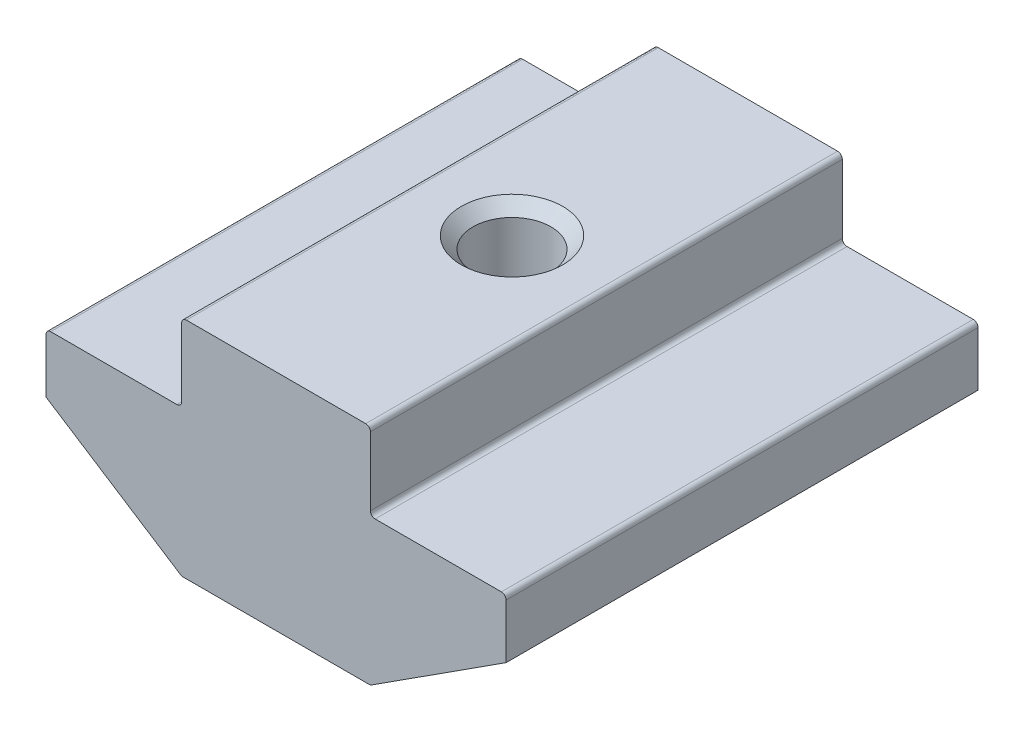
ISO-10303-21;
HEADER;
FILE_DESCRIPTION(('STEP AP214'),'2;1');
FILE_NAME('part.step','',(''),(''),'','','');
FILE_SCHEMA(('AUTOMOTIVE_DESIGN { 1 0 10303 214 1 1 1 1 }'));
ENDSEC;
DATA;
#1=APPLICATION_CONTEXT('core data for automotive mechanical design processes');
#2=APPLICATION_PROTOCOL_DEFINITION('international standard','automotive_design',2000,#1);
#3=PRODUCT_CONTEXT('',#1,'mechanical');
#4=PRODUCT('Part','Part','',(#3));
#5=PRODUCT_RELATED_PRODUCT_CATEGORY('part','',(#4));
#6=PRODUCT_DEFINITION_FORMATION('','',#4);
#7=PRODUCT_DEFINITION_CONTEXT('part definition',#1,'design');
#8=PRODUCT_DEFINITION('design','',#6,#7);
#9=PRODUCT_DEFINITION_SHAPE('','',#8);
#10=(LENGTH_UNIT() NAMED_UNIT(*) SI_UNIT(.MILLI.,.METRE.));
#11=(NAMED_UNIT(*) PLANE_ANGLE_UNIT() SI_UNIT($,.RADIAN.));
#12=(NAMED_UNIT(*) SI_UNIT($,.STERADIAN.) SOLID_ANGLE_UNIT());
#13=UNCERTAINTY_MEASURE_WITH_UNIT(LENGTH_MEASURE(1.E-05),#10,'distance_accuracy_value','');
#14=(GEOMETRIC_REPRESENTATION_CONTEXT(3) GLOBAL_UNCERTAINTY_ASSIGNED_CONTEXT((#13)) GLOBAL_UNIT_ASSIGNED_CONTEXT((#10,
#11,#12)) REPRESENTATION_CONTEXT('',''));
#15=CARTESIAN_POINT('',(0.,0.,0.));
#16=DIRECTION('',(0.,0.,1.));
#17=DIRECTION('',(1.,0.,0.));
#18=AXIS2_PLACEMENT_3D('',#15,#16,#17);
#19=CARTESIAN_POINT('',(-4.,0.,10.));
#20=DIRECTION('',(1.,0.,0.));
#21=DIRECTION('',(0.,0.,-1.));
#22=AXIS2_PLACEMENT_3D('',#19,#20,#21);
#23=PLANE('',#22);
#24=DIRECTION('',(0.,-1.,0.));
#25=VECTOR('',#24,1.);
#26=CARTESIAN_POINT('',(-4.,0.,10.));
#27=LINE('',#26,#25);
#28=CARTESIAN_POINT('',(-4.,-0.200000000000002,10.));
#29=VERTEX_POINT('',#28);
#30=CARTESIAN_POINT('',(-4.,-3.1,10.));
#31=VERTEX_POINT('',#30);
#32=EDGE_CURVE('E234',#29,#31,#27,.T.);
#33=ORIENTED_EDGE('',*,*,#32,.F.);
#34=DIRECTION('',(0.,0.,-1.));
#35=VECTOR('',#34,1.);
#36=CARTESIAN_POINT('',(-4.,-0.200000000000002,10.));
#37=LINE('',#36,#35);
#38=CARTESIAN_POINT('',(-4.,-0.200000000000002,-10.));
#39=VERTEX_POINT('',#38);
#40=EDGE_CURVE('E285',#29,#39,#37,.T.);
#41=ORIENTED_EDGE('',*,*,#40,.T.);
#42=DIRECTION('',(0.,-1.,0.));
#43=VECTOR('',#42,1.);
#44=CARTESIAN_POINT('',(-4.,0.,-10.));
#45=LINE('',#44,#43);
#46=CARTESIAN_POINT('',(-4.,-3.1,-10.));
#47=VERTEX_POINT('',#46);
#48=EDGE_CURVE('E208',#39,#47,#45,.T.);
#49=ORIENTED_EDGE('',*,*,#48,.T.);
#50=DIRECTION('',(0.,0.,-1.));
#51=VECTOR('',#50,1.);
#52=CARTESIAN_POINT('',(-4.,-3.1,10.));
#53=LINE('',#52,#51);
#54=EDGE_CURVE('E283',#47,#31,#53,.F.);
#55=ORIENTED_EDGE('',*,*,#54,.T.);
#56=EDGE_LOOP('',(#33,#41,#49,#55));
#57=FACE_BOUND('',#56,.T.);
#58=ADVANCED_FACE('F37',(#57),#23,.F.);
#59=CARTESIAN_POINT('',(-4.,-3.3,10.));
#60=DIRECTION('',(0.,-1.,0.));
#61=DIRECTION('',(1.,0.,0.));
#62=AXIS2_PLACEMENT_3D('',#59,#60,#61);
#63=PLANE('',#62);
#64=DIRECTION('',(-1.,0.,0.));
#65=VECTOR('',#64,1.);
#66=CARTESIAN_POINT('',(-4.,-3.3,-10.));
#67=LINE('',#66,#65);
#68=CARTESIAN_POINT('',(-4.2,-3.3,-10.));
#69=VERTEX_POINT('',#68);
#70=CARTESIAN_POINT('',(-9.55,-3.3,-10.));
#71=VERTEX_POINT('',#70);
#72=EDGE_CURVE('E211',#69,#71,#67,.T.);
#73=ORIENTED_EDGE('',*,*,#72,.T.);
#74=DIRECTION('',(0.,0.,-1.));
#75=VECTOR('',#74,1.);
#76=CARTESIAN_POINT('',(-9.55,-3.3,10.));
#77=LINE('',#76,#75);
#78=CARTESIAN_POINT('',(-9.55,-3.3,10.));
#79=VERTEX_POINT('',#78);
#80=EDGE_CURVE('E293',#71,#79,#77,.F.);
#81=ORIENTED_EDGE('',*,*,#80,.T.);
#82=DIRECTION('',(-1.,0.,0.));
#83=VECTOR('',#82,1.);
#84=CARTESIAN_POINT('',(-4.,-3.3,10.));
#85=LINE('',#84,#83);
#86=CARTESIAN_POINT('',(-4.2,-3.3,10.));
#87=VERTEX_POINT('',#86);
#88=EDGE_CURVE('E175',#87,#79,#85,.T.);
#89=ORIENTED_EDGE('',*,*,#88,.F.);
#90=DIRECTION('',(0.,0.,-1.));
#91=VECTOR('',#90,1.);
#92=CARTESIAN_POINT('',(-4.2,-3.3,-10.));
#93=LINE('',#92,#91);
#94=EDGE_CURVE('E290',#87,#69,#93,.T.);
#95=ORIENTED_EDGE('',*,*,#94,.T.);
#96=EDGE_LOOP('',(#73,#81,#89,#95));
#97=FACE_BOUND('',#96,.T.);
#98=ADVANCED_FACE('F313',(#97),#63,.F.);
#99=CARTESIAN_POINT('',(-9.75,-3.3,10.));
#100=DIRECTION('',(1.,0.,0.));
#101=DIRECTION('',(0.,0.,-1.));
#102=AXIS2_PLACEMENT_3D('',#99,#100,#101);
#103=PLANE('',#102);
#104=DIRECTION('',(0.,-1.,0.));
#105=VECTOR('',#104,1.);
#106=CARTESIAN_POINT('',(-9.75,-3.3,10.));
#107=LINE('',#106,#105);
#108=CARTESIAN_POINT('',(-9.75,-3.5,10.));
#109=VERTEX_POINT('',#108);
#110=CARTESIAN_POINT('',(-9.75,-5.8,10.));
#111=VERTEX_POINT('',#110);
#112=EDGE_CURVE('E162',#109,#111,#107,.T.);
#113=ORIENTED_EDGE('',*,*,#112,.F.);
#114=DIRECTION('',(0.,0.,-1.));
#115=VECTOR('',#114,1.);
#116=CARTESIAN_POINT('',(-9.75,-3.5,10.));
#117=LINE('',#116,#115);
#118=CARTESIAN_POINT('',(-9.75,-3.5,-10.));
#119=VERTEX_POINT('',#118);
#120=EDGE_CURVE('E288',#109,#119,#117,.T.);
#121=ORIENTED_EDGE('',*,*,#120,.T.);
#122=DIRECTION('',(0.,-1.,0.));
#123=VECTOR('',#122,1.);
#124=CARTESIAN_POINT('',(-9.75,-3.3,-10.));
#125=LINE('',#124,#123);
#126=CARTESIAN_POINT('',(-9.75,-5.8,-10.));
#127=VERTEX_POINT('',#126);
#128=EDGE_CURVE('E181',#119,#127,#125,.T.);
#129=ORIENTED_EDGE('',*,*,#128,.T.);
#130=DIRECTION('',(0.,0.,-1.));
#131=VECTOR('',#130,1.);
#132=CARTESIAN_POINT('',(-9.75,-5.8,10.));
#133=LINE('',#132,#131);
#134=EDGE_CURVE('E178',#111,#127,#133,.T.);
#135=ORIENTED_EDGE('',*,*,#134,.F.);
#136=EDGE_LOOP('',(#113,#121,#129,#135));
#137=FACE_BOUND('',#136,.T.);
#138=ADVANCED_FACE('F179',(#137),#103,.F.);
#139=CARTESIAN_POINT('',(-9.75,-5.8,10.));
#140=DIRECTION('',(0.541127125407786,0.840940802998586,0.));
#141=DIRECTION('',(-0.840940802998586,0.541127125407786,0.));
#142=AXIS2_PLACEMENT_3D('',#139,#140,#141);
#143=PLANE('',#142);
#144=DIRECTION('',(0.840940802998586,-0.541127125407786,0.));
#145=VECTOR('',#144,1.);
#146=CARTESIAN_POINT('',(-9.75,-5.8,-10.));
#147=LINE('',#146,#145);
#148=CARTESIAN_POINT('',(-4.04943731798692,-9.46818816059972,-10.));
#149=VERTEX_POINT('',#148);
#150=EDGE_CURVE('E216',#127,#149,#147,.T.);
#151=ORIENTED_EDGE('',*,*,#150,.T.);
#152=DIRECTION('',(0.,0.,-1.));
#153=VECTOR('',#152,1.);
#154=CARTESIAN_POINT('',(-4.04943731798692,-9.46818816059972,10.));
#155=LINE('',#154,#153);
#156=CARTESIAN_POINT('',(-4.04943731798692,-9.46818816059972,10.));
#157=VERTEX_POINT('',#156);
#158=EDGE_CURVE('E190',#149,#157,#155,.F.);
#159=ORIENTED_EDGE('',*,*,#158,.T.);
#160=DIRECTION('',(0.840940802998586,-0.541127125407786,0.));
#161=VECTOR('',#160,1.);
#162=CARTESIAN_POINT('',(-9.75,-5.8,10.));
#163=LINE('',#162,#161);
#164=EDGE_CURVE('E167',#111,#157,#163,.T.);
#165=ORIENTED_EDGE('',*,*,#164,.F.);
#166=ORIENTED_EDGE('',*,*,#134,.T.);
#167=EDGE_LOOP('',(#151,#159,#165,#166));
#168=FACE_BOUND('',#167,.T.);
#169=ADVANCED_FACE('F188',(#168),#143,.F.);
#170=CARTESIAN_POINT('',(-4.,-9.5,10.));
#171=DIRECTION('',(0.,1.,0.));
#172=DIRECTION('',(0.,0.,1.));
#173=AXIS2_PLACEMENT_3D('',#170,#171,#172);
#174=PLANE('',#173);
#175=CARTESIAN_POINT('',(0.,-9.5,0.));
#176=DIRECTION('',(0.,1.,0.));
#177=DIRECTION('',(0.,0.,1.));
#178=AXIS2_PLACEMENT_3D('',#175,#176,#177);
#179=CIRCLE('',#178,2.15);
#180=CARTESIAN_POINT('',(0.,-9.5,2.15));
#181=VERTEX_POINT('',#180);
#182=EDGE_CURVE('E325',#181,#181,#179,.T.);
#183=ORIENTED_EDGE('',*,*,#182,.T.);
#184=EDGE_LOOP('',(#183));
#185=FACE_BOUND('',#184,.T.);
#186=DIRECTION('',(1.,0.,0.));
#187=VECTOR('',#186,1.);
#188=CARTESIAN_POINT('',(-4.,-9.5,-10.));
#189=LINE('',#188,#187);
#190=CARTESIAN_POINT('',(-3.94121189290537,-9.5,-10.));
#191=VERTEX_POINT('',#190);
#192=CARTESIAN_POINT('',(3.94121189290537,-9.5,-10.));
#193=VERTEX_POINT('',#192);
#194=EDGE_CURVE('E218',#191,#193,#189,.T.);
#195=ORIENTED_EDGE('',*,*,#194,.T.);
#196=DIRECTION('',(0.,0.,-1.));
#197=VECTOR('',#196,1.);
#198=CARTESIAN_POINT('',(3.94121189290537,-9.5,10.));
#199=LINE('',#198,#197);
#200=CARTESIAN_POINT('',(3.94121189290537,-9.5,10.));
#201=VERTEX_POINT('',#200);
#202=EDGE_CURVE('E254',#193,#201,#199,.F.);
#203=ORIENTED_EDGE('',*,*,#202,.T.);
#204=DIRECTION('',(1.,0.,0.));
#205=VECTOR('',#204,1.);
#206=CARTESIAN_POINT('',(-4.,-9.5,10.));
#207=LINE('',#206,#205);
#208=CARTESIAN_POINT('',(-3.94121189290537,-9.5,10.));
#209=VERTEX_POINT('',#208);
#210=EDGE_CURVE('E191',#209,#201,#207,.T.);
#211=ORIENTED_EDGE('',*,*,#210,.F.);
#212=DIRECTION('',(0.,0.,-1.));
#213=VECTOR('',#212,1.);
#214=CARTESIAN_POINT('',(-3.94121189290537,-9.5,10.));
#215=LINE('',#214,#213);
#216=EDGE_CURVE('E251',#209,#191,#215,.T.);
#217=ORIENTED_EDGE('',*,*,#216,.T.);
#218=EDGE_LOOP('',(#195,#203,#211,#217));
#219=FACE_BOUND('',#218,.T.);
#220=ADVANCED_FACE('F329',(#185,#219),#174,.F.);
#221=CARTESIAN_POINT('',(9.75,-5.8,10.));
#222=DIRECTION('',(-0.541127125407786,0.840940802998586,0.));
#223=DIRECTION('',(-0.840940802998586,-0.541127125407786,0.));
#224=AXIS2_PLACEMENT_3D('',#221,#222,#223);
#225=PLANE('',#224);
#226=DIRECTION('',(0.840940802998586,0.541127125407786,0.));
#227=VECTOR('',#226,1.);
#228=CARTESIAN_POINT('',(9.75,-5.8,10.));
#229=LINE('',#228,#227);
#230=CARTESIAN_POINT('',(4.04943731798692,-9.46818816059972,10.));
#231=VERTEX_POINT('',#230);
#232=CARTESIAN_POINT('',(9.75,-5.8,10.));
#233=VERTEX_POINT('',#232);
#234=EDGE_CURVE('E193',#231,#233,#229,.T.);
#235=ORIENTED_EDGE('',*,*,#234,.F.);
#236=DIRECTION('',(0.,0.,-1.));
#237=VECTOR('',#236,1.);
#238=CARTESIAN_POINT('',(4.04943731798692,-9.46818816059972,10.));
#239=LINE('',#238,#237);
#240=CARTESIAN_POINT('',(4.04943731798692,-9.46818816059972,-10.));
#241=VERTEX_POINT('',#240);
#242=EDGE_CURVE('E185',#231,#241,#239,.T.);
#243=ORIENTED_EDGE('',*,*,#242,.T.);
#244=DIRECTION('',(0.840940802998586,0.541127125407786,0.));
#245=VECTOR('',#244,1.);
#246=CARTESIAN_POINT('',(9.75,-5.8,-10.));
#247=LINE('',#246,#245);
#248=CARTESIAN_POINT('',(9.75,-5.8,-10.));
#249=VERTEX_POINT('',#248);
#250=EDGE_CURVE('E221',#241,#249,#247,.T.);
#251=ORIENTED_EDGE('',*,*,#250,.T.);
#252=DIRECTION('',(0.,0.,-1.));
#253=VECTOR('',#252,1.);
#254=CARTESIAN_POINT('',(9.75,-5.8,10.));
#255=LINE('',#254,#253);
#256=EDGE_CURVE('E186',#233,#249,#255,.T.);
#257=ORIENTED_EDGE('',*,*,#256,.F.);
#258=EDGE_LOOP('',(#235,#243,#251,#257));
#259=FACE_BOUND('',#258,.T.);
#260=ADVANCED_FACE('F385',(#259),#225,.F.);
#261=CARTESIAN_POINT('',(9.75,-3.3,10.));
#262=DIRECTION('',(-1.,0.,0.));
#263=DIRECTION('',(0.,0.,1.));
#264=AXIS2_PLACEMENT_3D('',#261,#262,#263);
#265=PLANE('',#264);
#266=DIRECTION('',(0.,1.,0.));
#267=VECTOR('',#266,1.);
#268=CARTESIAN_POINT('',(9.75,-3.3,-10.));
#269=LINE('',#268,#267);
#270=CARTESIAN_POINT('',(9.75,-3.5,-10.));
#271=VERTEX_POINT('',#270);
#272=EDGE_CURVE('E223',#249,#271,#269,.T.);
#273=ORIENTED_EDGE('',*,*,#272,.T.);
#274=DIRECTION('',(0.,0.,-1.));
#275=VECTOR('',#274,1.);
#276=CARTESIAN_POINT('',(9.75,-3.5,10.));
#277=LINE('',#276,#275);
#278=CARTESIAN_POINT('',(9.75,-3.5,10.));
#279=VERTEX_POINT('',#278);
#280=EDGE_CURVE('E272',#271,#279,#277,.F.);
#281=ORIENTED_EDGE('',*,*,#280,.T.);
#282=DIRECTION('',(0.,1.,0.));
#283=VECTOR('',#282,1.);
#284=CARTESIAN_POINT('',(9.75,-3.3,10.));
#285=LINE('',#284,#283);
#286=EDGE_CURVE('E198',#233,#279,#285,.T.);
#287=ORIENTED_EDGE('',*,*,#286,.F.);
#288=ORIENTED_EDGE('',*,*,#256,.T.);
#289=EDGE_LOOP('',(#273,#281,#287,#288));
#290=FACE_BOUND('',#289,.T.);
#291=ADVANCED_FACE('F380',(#290),#265,.F.);
#292=CARTESIAN_POINT('',(4.,-3.3,10.));
#293=DIRECTION('',(0.,-1.,0.));
#294=DIRECTION('',(1.,0.,0.));
#295=AXIS2_PLACEMENT_3D('',#292,#293,#294);
#296=PLANE('',#295);
#297=DIRECTION('',(-1.,0.,0.));
#298=VECTOR('',#297,1.);
#299=CARTESIAN_POINT('',(4.,-3.3,10.));
#300=LINE('',#299,#298);
#301=CARTESIAN_POINT('',(9.55,-3.3,10.));
#302=VERTEX_POINT('',#301);
#303=CARTESIAN_POINT('',(4.2,-3.3,10.));
#304=VERTEX_POINT('',#303);
#305=EDGE_CURVE('E201',#302,#304,#300,.T.);
#306=ORIENTED_EDGE('',*,*,#305,.F.);
#307=DIRECTION('',(0.,0.,-1.));
#308=VECTOR('',#307,1.);
#309=CARTESIAN_POINT('',(9.55,-3.3,10.));
#310=LINE('',#309,#308);
#311=CARTESIAN_POINT('',(9.55,-3.3,-10.));
#312=VERTEX_POINT('',#311);
#313=EDGE_CURVE('E269',#302,#312,#310,.T.);
#314=ORIENTED_EDGE('',*,*,#313,.T.);
#315=DIRECTION('',(-1.,0.,0.));
#316=VECTOR('',#315,1.);
#317=CARTESIAN_POINT('',(4.,-3.3,-10.));
#318=LINE('',#317,#316);
#319=CARTESIAN_POINT('',(4.2,-3.3,-10.));
#320=VERTEX_POINT('',#319);
#321=EDGE_CURVE('E226',#312,#320,#318,.T.);
#322=ORIENTED_EDGE('',*,*,#321,.T.);
#323=DIRECTION('',(0.,0.,-1.));
#324=VECTOR('',#323,1.);
#325=CARTESIAN_POINT('',(4.2,-3.3,10.));
#326=LINE('',#325,#324);
#327=EDGE_CURVE('E267',#320,#304,#326,.F.);
#328=ORIENTED_EDGE('',*,*,#327,.T.);
#329=EDGE_LOOP('',(#306,#314,#322,#328));
#330=FACE_BOUND('',#329,.T.);
#331=ADVANCED_FACE('F372',(#330),#296,.F.);
#332=CARTESIAN_POINT('',(4.,0.,10.));
#333=DIRECTION('',(-1.,0.,0.));
#334=DIRECTION('',(0.,0.,1.));
#335=AXIS2_PLACEMENT_3D('',#332,#333,#334);
#336=PLANE('',#335);
#337=DIRECTION('',(0.,1.,0.));
#338=VECTOR('',#337,1.);
#339=CARTESIAN_POINT('',(4.,0.,10.));
#340=LINE('',#339,#338);
#341=CARTESIAN_POINT('',(4.,-3.1,10.));
#342=VERTEX_POINT('',#341);
#343=CARTESIAN_POINT('',(4.,-0.199999999999998,10.));
#344=VERTEX_POINT('',#343);
#345=EDGE_CURVE('E204',#342,#344,#340,.T.);
#346=ORIENTED_EDGE('',*,*,#345,.F.);
#347=DIRECTION('',(0.,0.,-1.));
#348=VECTOR('',#347,1.);
#349=CARTESIAN_POINT('',(4.,-3.1,-10.));
#350=LINE('',#349,#348);
#351=CARTESIAN_POINT('',(4.,-3.1,-10.));
#352=VERTEX_POINT('',#351);
#353=EDGE_CURVE('E276',#342,#352,#350,.T.);
#354=ORIENTED_EDGE('',*,*,#353,.T.);
#355=DIRECTION('',(0.,1.,0.));
#356=VECTOR('',#355,1.);
#357=CARTESIAN_POINT('',(4.,0.,-10.));
#358=LINE('',#357,#356);
#359=CARTESIAN_POINT('',(4.,-0.199999999999998,-10.));
#360=VERTEX_POINT('',#359);
#361=EDGE_CURVE('E229',#352,#360,#358,.T.);
#362=ORIENTED_EDGE('',*,*,#361,.T.);
#363=DIRECTION('',(0.,0.,-1.));
#364=VECTOR('',#363,1.);
#365=CARTESIAN_POINT('',(4.,-0.199999999999998,10.));
#366=LINE('',#365,#364);
#367=EDGE_CURVE('E274',#360,#344,#366,.F.);
#368=ORIENTED_EDGE('',*,*,#367,.T.);
#369=EDGE_LOOP('',(#346,#354,#362,#368));
#370=FACE_BOUND('',#369,.T.);
#371=ADVANCED_FACE('F353',(#370),#336,.F.);
#372=CARTESIAN_POINT('',(4.,0.,10.));
#373=DIRECTION('',(0.,-1.,0.));
#374=DIRECTION('',(1.,0.,0.));
#375=AXIS2_PLACEMENT_3D('',#372,#373,#374);
#376=PLANE('',#375);
#377=CARTESIAN_POINT('',(0.,0.,0.));
#378=DIRECTION('',(0.,1.,0.));
#379=DIRECTION('',(0.,0.,1.));
#380=AXIS2_PLACEMENT_3D('',#377,#378,#379);
#381=CIRCLE('',#380,2.15);
#382=CARTESIAN_POINT('',(0.,0.,2.15));
#383=VERTEX_POINT('',#382);
#384=EDGE_CURVE('E322',#383,#383,#381,.T.);
#385=ORIENTED_EDGE('',*,*,#384,.F.);
#386=EDGE_LOOP('',(#385));
#387=FACE_BOUND('',#386,.T.);
#388=DIRECTION('',(-1.,0.,0.));
#389=VECTOR('',#388,1.);
#390=CARTESIAN_POINT('',(4.,0.,10.));
#391=LINE('',#390,#389);
#392=CARTESIAN_POINT('',(3.8,0.,10.));
#393=VERTEX_POINT('',#392);
#394=CARTESIAN_POINT('',(-3.8,0.,10.));
#395=VERTEX_POINT('',#394);
#396=EDGE_CURVE('E206',#393,#395,#391,.T.);
#397=ORIENTED_EDGE('',*,*,#396,.F.);
#398=DIRECTION('',(0.,0.,-1.));
#399=VECTOR('',#398,1.);
#400=CARTESIAN_POINT('',(3.8,0.,10.));
#401=LINE('',#400,#399);
#402=CARTESIAN_POINT('',(3.8,0.,-10.));
#403=VERTEX_POINT('',#402);
#404=EDGE_CURVE('E280',#393,#403,#401,.T.);
#405=ORIENTED_EDGE('',*,*,#404,.T.);
#406=DIRECTION('',(-1.,0.,0.));
#407=VECTOR('',#406,1.);
#408=CARTESIAN_POINT('',(4.,0.,-10.));
#409=LINE('',#408,#407);
#410=CARTESIAN_POINT('',(-3.8,0.,-10.));
#411=VERTEX_POINT('',#410);
#412=EDGE_CURVE('E232',#403,#411,#409,.T.);
#413=ORIENTED_EDGE('',*,*,#412,.T.);
#414=DIRECTION('',(0.,0.,-1.));
#415=VECTOR('',#414,1.);
#416=CARTESIAN_POINT('',(-3.8,0.,10.));
#417=LINE('',#416,#415);
#418=EDGE_CURVE('E52',#411,#395,#417,.F.);
#419=ORIENTED_EDGE('',*,*,#418,.T.);
#420=EDGE_LOOP('',(#397,#405,#413,#419));
#421=FACE_BOUND('',#420,.T.);
#422=ADVANCED_FACE('F351',(#387,#421),#376,.F.);
#423=CARTESIAN_POINT('',(0.,0.,10.));
#424=DIRECTION('',(0.,0.,-1.));
#425=DIRECTION('',(-1.,0.,0.));
#426=AXIS2_PLACEMENT_3D('',#423,#424,#425);
#427=PLANE('',#426);
#428=ORIENTED_EDGE('',*,*,#210,.T.);
#429=CARTESIAN_POINT('',(3.94121189290537,-9.3,10.));
#430=DIRECTION('',(0.,0.,-1.));
#431=DIRECTION('',(-1.,0.,0.));
#432=AXIS2_PLACEMENT_3D('',#429,#430,#431);
#433=CIRCLE('',#432,0.2);
#434=EDGE_CURVE('E264',#201,#231,#433,.F.);
#435=ORIENTED_EDGE('',*,*,#434,.T.);
#436=ORIENTED_EDGE('',*,*,#234,.T.);
#437=ORIENTED_EDGE('',*,*,#286,.T.);
#438=CARTESIAN_POINT('',(9.55,-3.5,10.));
#439=DIRECTION('',(0.,0.,-1.));
#440=DIRECTION('',(-1.,0.,0.));
#441=AXIS2_PLACEMENT_3D('',#438,#439,#440);
#442=CIRCLE('',#441,0.2);
#443=EDGE_CURVE('E260',#279,#302,#442,.F.);
#444=ORIENTED_EDGE('',*,*,#443,.T.);
#445=ORIENTED_EDGE('',*,*,#305,.T.);
#446=CARTESIAN_POINT('',(4.2,-3.1,10.));
#447=DIRECTION('',(0.,0.,-1.));
#448=DIRECTION('',(-1.,0.,0.));
#449=AXIS2_PLACEMENT_3D('',#446,#447,#448);
#450=CIRCLE('',#449,0.2);
#451=EDGE_CURVE('E297',#304,#342,#450,.T.);
#452=ORIENTED_EDGE('',*,*,#451,.T.);
#453=ORIENTED_EDGE('',*,*,#345,.T.);
#454=CARTESIAN_POINT('',(3.8,-0.199999999999998,10.));
#455=DIRECTION('',(0.,0.,-1.));
#456=DIRECTION('',(-1.,0.,0.));
#457=AXIS2_PLACEMENT_3D('',#454,#455,#456);
#458=CIRCLE('',#457,0.2);
#459=EDGE_CURVE('E59',#344,#393,#458,.F.);
#460=ORIENTED_EDGE('',*,*,#459,.T.);
#461=ORIENTED_EDGE('',*,*,#396,.T.);
#462=CARTESIAN_POINT('',(-3.8,-0.200000000000002,10.));
#463=DIRECTION('',(0.,0.,-1.));
#464=DIRECTION('',(-1.,0.,0.));
#465=AXIS2_PLACEMENT_3D('',#462,#463,#464);
#466=CIRCLE('',#465,0.2);
#467=EDGE_CURVE('E257',#395,#29,#466,.F.);
#468=ORIENTED_EDGE('',*,*,#467,.T.);
#469=ORIENTED_EDGE('',*,*,#32,.T.);
#470=CARTESIAN_POINT('',(-4.2,-3.1,10.));
#471=DIRECTION('',(0.,0.,-1.));
#472=DIRECTION('',(-1.,0.,0.));
#473=AXIS2_PLACEMENT_3D('',#470,#471,#472);
#474=CIRCLE('',#473,0.2);
#475=EDGE_CURVE('E11',#31,#87,#474,.T.);
#476=ORIENTED_EDGE('',*,*,#475,.T.);
#477=ORIENTED_EDGE('',*,*,#88,.T.);
#478=CARTESIAN_POINT('',(-9.55,-3.5,10.));
#479=DIRECTION('',(0.,0.,-1.));
#480=DIRECTION('',(-1.,0.,0.));
#481=AXIS2_PLACEMENT_3D('',#478,#479,#480);
#482=CIRCLE('',#481,0.2);
#483=EDGE_CURVE('E171',#79,#109,#482,.F.);
#484=ORIENTED_EDGE('',*,*,#483,.T.);
#485=ORIENTED_EDGE('',*,*,#112,.T.);
#486=ORIENTED_EDGE('',*,*,#164,.T.);
#487=CARTESIAN_POINT('',(-3.94121189290537,-9.3,10.));
#488=DIRECTION('',(0.,0.,-1.));
#489=DIRECTION('',(-1.,0.,0.));
#490=AXIS2_PLACEMENT_3D('',#487,#488,#489);
#491=CIRCLE('',#490,0.2);
#492=EDGE_CURVE('E262',#157,#209,#491,.F.);
#493=ORIENTED_EDGE('',*,*,#492,.T.);
#494=EDGE_LOOP('',(#428,#435,#436,#437,#444,#445,#452,#453,#460,#461,#468,#469,#476,#477,#484,
#485,#486,#493));
#495=FACE_BOUND('',#494,.T.);
#496=ADVANCED_FACE('F165',(#495),#427,.F.);
#497=CARTESIAN_POINT('',(0.,0.,-10.));
#498=DIRECTION('',(0.,0.,-1.));
#499=DIRECTION('',(-1.,0.,0.));
#500=AXIS2_PLACEMENT_3D('',#497,#498,#499);
#501=PLANE('',#500);
#502=ORIENTED_EDGE('',*,*,#250,.F.);
#503=CARTESIAN_POINT('',(3.94121189290537,-9.3,-10.));
#504=DIRECTION('',(0.,0.,-1.));
#505=DIRECTION('',(-1.,0.,0.));
#506=AXIS2_PLACEMENT_3D('',#503,#504,#505);
#507=CIRCLE('',#506,0.2);
#508=EDGE_CURVE('E249',#241,#193,#507,.T.);
#509=ORIENTED_EDGE('',*,*,#508,.T.);
#510=ORIENTED_EDGE('',*,*,#194,.F.);
#511=CARTESIAN_POINT('',(-3.94121189290537,-9.3,-10.));
#512=DIRECTION('',(0.,0.,-1.));
#513=DIRECTION('',(-1.,0.,0.));
#514=AXIS2_PLACEMENT_3D('',#511,#512,#513);
#515=CIRCLE('',#514,0.2);
#516=EDGE_CURVE('E247',#191,#149,#515,.T.);
#517=ORIENTED_EDGE('',*,*,#516,.T.);
#518=ORIENTED_EDGE('',*,*,#150,.F.);
#519=ORIENTED_EDGE('',*,*,#128,.F.);
#520=CARTESIAN_POINT('',(-9.55,-3.5,-10.));
#521=DIRECTION('',(0.,0.,-1.));
#522=DIRECTION('',(-1.,0.,0.));
#523=AXIS2_PLACEMENT_3D('',#520,#521,#522);
#524=CIRCLE('',#523,0.2);
#525=EDGE_CURVE('E239',#119,#71,#524,.T.);
#526=ORIENTED_EDGE('',*,*,#525,.T.);
#527=ORIENTED_EDGE('',*,*,#72,.F.);
#528=CARTESIAN_POINT('',(-4.2,-3.1,-10.));
#529=DIRECTION('',(0.,0.,-1.));
#530=DIRECTION('',(-1.,0.,0.));
#531=AXIS2_PLACEMENT_3D('',#528,#529,#530);
#532=CIRCLE('',#531,0.2);
#533=EDGE_CURVE('E45',#69,#47,#532,.F.);
#534=ORIENTED_EDGE('',*,*,#533,.T.);
#535=ORIENTED_EDGE('',*,*,#48,.F.);
#536=CARTESIAN_POINT('',(-3.8,-0.200000000000002,-10.));
#537=DIRECTION('',(0.,0.,-1.));
#538=DIRECTION('',(-1.,0.,0.));
#539=AXIS2_PLACEMENT_3D('',#536,#537,#538);
#540=CIRCLE('',#539,0.2);
#541=EDGE_CURVE('E241',#39,#411,#540,.T.);
#542=ORIENTED_EDGE('',*,*,#541,.T.);
#543=ORIENTED_EDGE('',*,*,#412,.F.);
#544=CARTESIAN_POINT('',(3.8,-0.199999999999998,-10.));
#545=DIRECTION('',(0.,0.,-1.));
#546=DIRECTION('',(-1.,0.,0.));
#547=AXIS2_PLACEMENT_3D('',#544,#545,#546);
#548=CIRCLE('',#547,0.2);
#549=EDGE_CURVE('E243',#403,#360,#548,.T.);
#550=ORIENTED_EDGE('',*,*,#549,.T.);
#551=ORIENTED_EDGE('',*,*,#361,.F.);
#552=CARTESIAN_POINT('',(4.2,-3.1,-10.));
#553=DIRECTION('',(0.,0.,-1.));
#554=DIRECTION('',(-1.,0.,0.));
#555=AXIS2_PLACEMENT_3D('',#552,#553,#554);
#556=CIRCLE('',#555,0.2);
#557=EDGE_CURVE('E295',#352,#320,#556,.F.);
#558=ORIENTED_EDGE('',*,*,#557,.T.);
#559=ORIENTED_EDGE('',*,*,#321,.F.);
#560=CARTESIAN_POINT('',(9.55,-3.5,-10.));
#561=DIRECTION('',(0.,0.,-1.));
#562=DIRECTION('',(-1.,0.,0.));
#563=AXIS2_PLACEMENT_3D('',#560,#561,#562);
#564=CIRCLE('',#563,0.2);
#565=EDGE_CURVE('E245',#312,#271,#564,.T.);
#566=ORIENTED_EDGE('',*,*,#565,.T.);
#567=ORIENTED_EDGE('',*,*,#272,.F.);
#568=EDGE_LOOP('',(#502,#509,#510,#517,#518,#519,#526,#527,#534,#535,#542,#543,#550,#551,#558,
#559,#566,#567));
#569=FACE_BOUND('',#568,.T.);
#570=ADVANCED_FACE('F302',(#569),#501,.T.);
#571=CARTESIAN_POINT('',(0.,-9.,0.));
#572=DIRECTION('',(0.,-1.,0.));
#573=DIRECTION('',(0.,0.,-1.));
#574=AXIS2_PLACEMENT_3D('',#571,#572,#573);
#575=CONICAL_SURFACE('',#574,1.65,0.785398163397447);
#576=ORIENTED_EDGE('',*,*,#182,.F.);
#577=EDGE_LOOP('',(#576));
#578=FACE_BOUND('',#577,.T.);
#579=CARTESIAN_POINT('',(0.,-9.,0.));
#580=DIRECTION('',(0.,1.,0.));
#581=DIRECTION('',(0.,0.,1.));
#582=AXIS2_PLACEMENT_3D('',#579,#580,#581);
#583=CIRCLE('',#582,1.65);
#584=CARTESIAN_POINT('',(0.,-9.,1.65));
#585=VERTEX_POINT('',#584);
#586=EDGE_CURVE('E212',#585,#585,#583,.T.);
#587=ORIENTED_EDGE('',*,*,#586,.T.);
#588=EDGE_LOOP('',(#587));
#589=FACE_BOUND('',#588,.T.);
#590=ADVANCED_FACE('F332',(#578,#589),#575,.F.);
#591=CARTESIAN_POINT('',(0.,0.,0.));
#592=DIRECTION('',(0.,1.,0.));
#593=DIRECTION('',(0.,0.,1.));
#594=AXIS2_PLACEMENT_3D('',#591,#592,#593);
#595=CYLINDRICAL_SURFACE('',#594,1.65);
#596=ORIENTED_EDGE('',*,*,#586,.F.);
#597=EDGE_LOOP('',(#596));
#598=FACE_BOUND('',#597,.T.);
#599=CARTESIAN_POINT('',(0.,-0.5,0.));
#600=DIRECTION('',(0.,1.,0.));
#601=DIRECTION('',(0.,0.,1.));
#602=AXIS2_PLACEMENT_3D('',#599,#600,#601);
#603=CIRCLE('',#602,1.65);
#604=CARTESIAN_POINT('',(0.,-0.5,1.65));
#605=VERTEX_POINT('',#604);
#606=EDGE_CURVE('E319',#605,#605,#603,.T.);
#607=ORIENTED_EDGE('',*,*,#606,.T.);
#608=EDGE_LOOP('',(#607));
#609=FACE_BOUND('',#608,.T.);
#610=ADVANCED_FACE('F335',(#598,#609),#595,.F.);
#611=CARTESIAN_POINT('',(0.,0.,0.));
#612=DIRECTION('',(0.,1.,0.));
#613=DIRECTION('',(0.,0.,1.));
#614=AXIS2_PLACEMENT_3D('',#611,#612,#613);
#615=CONICAL_SURFACE('',#614,2.15,0.785398163397449);
#616=ORIENTED_EDGE('',*,*,#606,.F.);
#617=EDGE_LOOP('',(#616));
#618=FACE_BOUND('',#617,.T.);
#619=ORIENTED_EDGE('',*,*,#384,.T.);
#620=EDGE_LOOP('',(#619));
#621=FACE_BOUND('',#620,.T.);
#622=ADVANCED_FACE('F341',(#618,#621),#615,.F.);
#623=CARTESIAN_POINT('',(3.94121189290537,-9.3,10.));
#624=DIRECTION('',(0.,0.,-1.));
#625=DIRECTION('',(-1.,0.,0.));
#626=AXIS2_PLACEMENT_3D('',#623,#624,#625);
#627=CYLINDRICAL_SURFACE('',#626,0.2);
#628=ORIENTED_EDGE('',*,*,#434,.F.);
#629=ORIENTED_EDGE('',*,*,#202,.F.);
#630=ORIENTED_EDGE('',*,*,#508,.F.);
#631=ORIENTED_EDGE('',*,*,#242,.F.);
#632=EDGE_LOOP('',(#628,#629,#630,#631));
#633=FACE_BOUND('',#632,.T.);
#634=ADVANCED_FACE('F347',(#633),#627,.T.);
#635=CARTESIAN_POINT('',(-3.94121189290537,-9.3,10.));
#636=DIRECTION('',(0.,0.,-1.));
#637=DIRECTION('',(-1.,0.,0.));
#638=AXIS2_PLACEMENT_3D('',#635,#636,#637);
#639=CYLINDRICAL_SURFACE('',#638,0.2);
#640=ORIENTED_EDGE('',*,*,#492,.F.);
#641=ORIENTED_EDGE('',*,*,#158,.F.);
#642=ORIENTED_EDGE('',*,*,#516,.F.);
#643=ORIENTED_EDGE('',*,*,#216,.F.);
#644=EDGE_LOOP('',(#640,#641,#642,#643));
#645=FACE_BOUND('',#644,.T.);
#646=ADVANCED_FACE('F394',(#645),#639,.T.);
#647=CARTESIAN_POINT('',(9.55,-3.5,10.));
#648=DIRECTION('',(0.,0.,-1.));
#649=DIRECTION('',(-1.,0.,0.));
#650=AXIS2_PLACEMENT_3D('',#647,#648,#649);
#651=CYLINDRICAL_SURFACE('',#650,0.2);
#652=ORIENTED_EDGE('',*,*,#443,.F.);
#653=ORIENTED_EDGE('',*,*,#280,.F.);
#654=ORIENTED_EDGE('',*,*,#565,.F.);
#655=ORIENTED_EDGE('',*,*,#313,.F.);
#656=EDGE_LOOP('',(#652,#653,#654,#655));
#657=FACE_BOUND('',#656,.T.);
#658=ADVANCED_FACE('F376',(#657),#651,.T.);
#659=CARTESIAN_POINT('',(4.2,-3.1,10.));
#660=DIRECTION('',(0.,0.,1.));
#661=DIRECTION('',(1.,0.,0.));
#662=AXIS2_PLACEMENT_3D('',#659,#660,#661);
#663=CYLINDRICAL_SURFACE('',#662,0.2);
#664=ORIENTED_EDGE('',*,*,#451,.F.);
#665=ORIENTED_EDGE('',*,*,#327,.F.);
#666=ORIENTED_EDGE('',*,*,#557,.F.);
#667=ORIENTED_EDGE('',*,*,#353,.F.);
#668=EDGE_LOOP('',(#664,#665,#666,#667));
#669=FACE_BOUND('',#668,.T.);
#670=ADVANCED_FACE('F367',(#669),#663,.F.);
#671=CARTESIAN_POINT('',(3.8,-0.199999999999998,10.));
#672=DIRECTION('',(0.,0.,-1.));
#673=DIRECTION('',(-1.,0.,0.));
#674=AXIS2_PLACEMENT_3D('',#671,#672,#673);
#675=CYLINDRICAL_SURFACE('',#674,0.2);
#676=ORIENTED_EDGE('',*,*,#459,.F.);
#677=ORIENTED_EDGE('',*,*,#367,.F.);
#678=ORIENTED_EDGE('',*,*,#549,.F.);
#679=ORIENTED_EDGE('',*,*,#404,.F.);
#680=EDGE_LOOP('',(#676,#677,#678,#679));
#681=FACE_BOUND('',#680,.T.);
#682=ADVANCED_FACE('F359',(#681),#675,.T.);
#683=CARTESIAN_POINT('',(-3.8,-0.200000000000002,10.));
#684=DIRECTION('',(0.,0.,-1.));
#685=DIRECTION('',(-1.,0.,0.));
#686=AXIS2_PLACEMENT_3D('',#683,#684,#685);
#687=CYLINDRICAL_SURFACE('',#686,0.2);
#688=ORIENTED_EDGE('',*,*,#467,.F.);
#689=ORIENTED_EDGE('',*,*,#418,.F.);
#690=ORIENTED_EDGE('',*,*,#541,.F.);
#691=ORIENTED_EDGE('',*,*,#40,.F.);
#692=EDGE_LOOP('',(#688,#689,#690,#691));
#693=FACE_BOUND('',#692,.T.);
#694=ADVANCED_FACE('F398',(#693),#687,.T.);
#695=CARTESIAN_POINT('',(-9.55,-3.5,10.));
#696=DIRECTION('',(0.,0.,-1.));
#697=DIRECTION('',(-1.,0.,0.));
#698=AXIS2_PLACEMENT_3D('',#695,#696,#697);
#699=CYLINDRICAL_SURFACE('',#698,0.2);
#700=ORIENTED_EDGE('',*,*,#483,.F.);
#701=ORIENTED_EDGE('',*,*,#80,.F.);
#702=ORIENTED_EDGE('',*,*,#525,.F.);
#703=ORIENTED_EDGE('',*,*,#120,.F.);
#704=EDGE_LOOP('',(#700,#701,#702,#703));
#705=FACE_BOUND('',#704,.T.);
#706=ADVANCED_FACE('F396',(#705),#699,.T.);
#707=CARTESIAN_POINT('',(-4.2,-3.1,10.));
#708=DIRECTION('',(0.,0.,1.));
#709=DIRECTION('',(1.,0.,0.));
#710=AXIS2_PLACEMENT_3D('',#707,#708,#709);
#711=CYLINDRICAL_SURFACE('',#710,0.2);
#712=ORIENTED_EDGE('',*,*,#475,.F.);
#713=ORIENTED_EDGE('',*,*,#54,.F.);
#714=ORIENTED_EDGE('',*,*,#533,.F.);
#715=ORIENTED_EDGE('',*,*,#94,.F.);
#716=EDGE_LOOP('',(#712,#713,#714,#715));
#717=FACE_BOUND('',#716,.T.);
#718=ADVANCED_FACE('F39',(#717),#711,.F.);
#719=CLOSED_SHELL('',(#58,#98,#138,#169,#220,#260,#291,#331,#371,#422,#496,#570,#590,#610,#622,
#634,#646,#658,#670,#682,#694,#706,#718));
#720=MANIFOLD_SOLID_BREP('B2',#719);
#721=ADVANCED_BREP_SHAPE_REPRESENTATION('',(#18,#720),#14);
#722=SHAPE_DEFINITION_REPRESENTATION(#9,#721);
ENDSEC;
END-ISO-10303-21;
